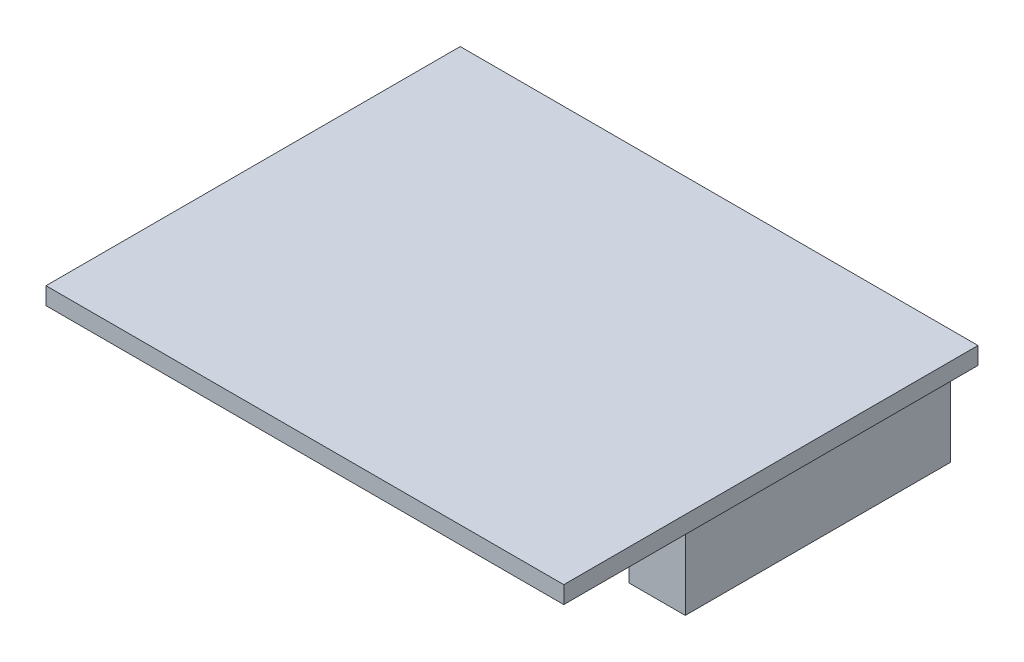
ISO-10303-21;
HEADER;
FILE_DESCRIPTION(('STEP AP214'),'2;1');
FILE_NAME('part.step','',(''),(''),'','','');
FILE_SCHEMA(('AUTOMOTIVE_DESIGN { 1 0 10303 214 1 1 1 1 }'));
ENDSEC;
DATA;
#1=APPLICATION_CONTEXT('core data for automotive mechanical design processes');
#2=APPLICATION_PROTOCOL_DEFINITION('international standard','automotive_design',2000,#1);
#3=PRODUCT_CONTEXT('',#1,'mechanical');
#4=PRODUCT('Part','Part','',(#3));
#5=PRODUCT_RELATED_PRODUCT_CATEGORY('part','',(#4));
#6=PRODUCT_DEFINITION_FORMATION('','',#4);
#7=PRODUCT_DEFINITION_CONTEXT('part definition',#1,'design');
#8=PRODUCT_DEFINITION('design','',#6,#7);
#9=PRODUCT_DEFINITION_SHAPE('','',#8);
#10=(LENGTH_UNIT() NAMED_UNIT(*) SI_UNIT(.MILLI.,.METRE.));
#11=(NAMED_UNIT(*) PLANE_ANGLE_UNIT() SI_UNIT($,.RADIAN.));
#12=(NAMED_UNIT(*) SI_UNIT($,.STERADIAN.) SOLID_ANGLE_UNIT());
#13=UNCERTAINTY_MEASURE_WITH_UNIT(LENGTH_MEASURE(1.E-05),#10,'distance_accuracy_value','');
#14=(GEOMETRIC_REPRESENTATION_CONTEXT(3) GLOBAL_UNCERTAINTY_ASSIGNED_CONTEXT((#13)) GLOBAL_UNIT_ASSIGNED_CONTEXT((#10,
#11,#12)) REPRESENTATION_CONTEXT('',''));
#15=CARTESIAN_POINT('',(0.,0.,0.));
#16=DIRECTION('',(0.,0.,1.));
#17=DIRECTION('',(1.,0.,0.));
#18=AXIS2_PLACEMENT_3D('',#15,#16,#17);
#19=CARTESIAN_POINT('',(0.,0.,0.));
#20=DIRECTION('',(0.,-1.,0.));
#21=DIRECTION('',(0.,0.,-1.));
#22=AXIS2_PLACEMENT_3D('',#19,#20,#21);
#23=PLANE('',#22);
#24=DIRECTION('',(0.,0.,-1.));
#25=VECTOR('',#24,1.);
#26=CARTESIAN_POINT('',(25.4,0.,20.32));
#27=LINE('',#26,#25);
#28=CARTESIAN_POINT('',(25.4,0.,20.32));
#29=VERTEX_POINT('',#28);
#30=CARTESIAN_POINT('',(25.4,0.,-20.32));
#31=VERTEX_POINT('',#30);
#32=EDGE_CURVE('E188',#29,#31,#27,.T.);
#33=ORIENTED_EDGE('',*,*,#32,.F.);
#34=DIRECTION('',(1.,0.,0.));
#35=VECTOR('',#34,1.);
#36=CARTESIAN_POINT('',(-25.4,0.,20.32));
#37=LINE('',#36,#35);
#38=CARTESIAN_POINT('',(-25.4,0.,20.32));
#39=VERTEX_POINT('',#38);
#40=EDGE_CURVE('E193',#39,#29,#37,.T.);
#41=ORIENTED_EDGE('',*,*,#40,.F.);
#42=DIRECTION('',(0.,0.,1.));
#43=VECTOR('',#42,1.);
#44=CARTESIAN_POINT('',(-25.4,0.,20.32));
#45=LINE('',#44,#43);
#46=CARTESIAN_POINT('',(-25.4,0.,-20.32));
#47=VERTEX_POINT('',#46);
#48=EDGE_CURVE('E204',#47,#39,#45,.T.);
#49=ORIENTED_EDGE('',*,*,#48,.F.);
#50=DIRECTION('',(-1.,0.,0.));
#51=VECTOR('',#50,1.);
#52=CARTESIAN_POINT('',(-25.4,0.,-20.32));
#53=LINE('',#52,#51);
#54=EDGE_CURVE('E202',#31,#47,#53,.T.);
#55=ORIENTED_EDGE('',*,*,#54,.F.);
#56=EDGE_LOOP('',(#33,#41,#49,#55));
#57=FACE_BOUND('',#56,.T.);
#58=DIRECTION('',(-1.,0.,0.));
#59=VECTOR('',#58,1.);
#60=CARTESIAN_POINT('',(-24.4,0.,6.68));
#61=LINE('',#60,#59);
#62=CARTESIAN_POINT('',(-19.4,0.,6.68));
#63=VERTEX_POINT('',#62);
#64=CARTESIAN_POINT('',(-24.4,0.,6.68));
#65=VERTEX_POINT('',#64);
#66=EDGE_CURVE('E174',#63,#65,#61,.T.);
#67=ORIENTED_EDGE('',*,*,#66,.F.);
#68=DIRECTION('',(0.,0.,1.));
#69=VECTOR('',#68,1.);
#70=CARTESIAN_POINT('',(-19.4,0.,-19.32));
#71=LINE('',#70,#69);
#72=CARTESIAN_POINT('',(-19.4,0.,-19.32));
#73=VERTEX_POINT('',#72);
#74=EDGE_CURVE('E171',#73,#63,#71,.T.);
#75=ORIENTED_EDGE('',*,*,#74,.F.);
#76=DIRECTION('',(1.,0.,0.));
#77=VECTOR('',#76,1.);
#78=CARTESIAN_POINT('',(-24.4,0.,-19.32));
#79=LINE('',#78,#77);
#80=CARTESIAN_POINT('',(-24.4,0.,-19.32));
#81=VERTEX_POINT('',#80);
#82=EDGE_CURVE('E164',#81,#73,#79,.T.);
#83=ORIENTED_EDGE('',*,*,#82,.F.);
#84=DIRECTION('',(0.,0.,-1.));
#85=VECTOR('',#84,1.);
#86=CARTESIAN_POINT('',(-24.4,0.,-19.32));
#87=LINE('',#86,#85);
#88=EDGE_CURVE('E177',#65,#81,#87,.T.);
#89=ORIENTED_EDGE('',*,*,#88,.F.);
#90=EDGE_LOOP('',(#67,#75,#83,#89));
#91=FACE_BOUND('',#90,.T.);
#92=DIRECTION('',(0.,0.,1.));
#93=VECTOR('',#92,1.);
#94=CARTESIAN_POINT('',(23.68,0.,-19.32));
#95=LINE('',#94,#93);
#96=CARTESIAN_POINT('',(23.68,0.,-19.32));
#97=VERTEX_POINT('',#96);
#98=CARTESIAN_POINT('',(23.68,0.,6.68));
#99=VERTEX_POINT('',#98);
#100=EDGE_CURVE('E141',#97,#99,#95,.T.);
#101=ORIENTED_EDGE('',*,*,#100,.F.);
#102=DIRECTION('',(1.,0.,0.));
#103=VECTOR('',#102,1.);
#104=CARTESIAN_POINT('',(18.18,0.,-19.32));
#105=LINE('',#104,#103);
#106=CARTESIAN_POINT('',(18.18,0.,-19.32));
#107=VERTEX_POINT('',#106);
#108=EDGE_CURVE('E50',#107,#97,#105,.T.);
#109=ORIENTED_EDGE('',*,*,#108,.F.);
#110=DIRECTION('',(0.,0.,-1.));
#111=VECTOR('',#110,1.);
#112=CARTESIAN_POINT('',(18.18,0.,-19.32));
#113=LINE('',#112,#111);
#114=CARTESIAN_POINT('',(18.18,0.,6.68));
#115=VERTEX_POINT('',#114);
#116=EDGE_CURVE('E147',#115,#107,#113,.T.);
#117=ORIENTED_EDGE('',*,*,#116,.F.);
#118=DIRECTION('',(-1.,0.,0.));
#119=VECTOR('',#118,1.);
#120=CARTESIAN_POINT('',(18.18,0.,6.68));
#121=LINE('',#120,#119);
#122=EDGE_CURVE('E132',#99,#115,#121,.T.);
#123=ORIENTED_EDGE('',*,*,#122,.F.);
#124=EDGE_LOOP('',(#101,#109,#117,#123));
#125=FACE_BOUND('',#124,.T.);
#126=ADVANCED_FACE('F35',(#57,#91,#125),#23,.T.);
#127=CARTESIAN_POINT('',(25.4,1.7,20.32));
#128=DIRECTION('',(-1.,0.,0.));
#129=DIRECTION('',(0.,0.,1.));
#130=AXIS2_PLACEMENT_3D('',#127,#128,#129);
#131=PLANE('',#130);
#132=ORIENTED_EDGE('',*,*,#32,.T.);
#133=DIRECTION('',(0.,-1.,0.));
#134=VECTOR('',#133,1.);
#135=CARTESIAN_POINT('',(25.4,1.7,-20.32));
#136=LINE('',#135,#134);
#137=CARTESIAN_POINT('',(25.4,1.7,-20.32));
#138=VERTEX_POINT('',#137);
#139=EDGE_CURVE('E11',#138,#31,#136,.T.);
#140=ORIENTED_EDGE('',*,*,#139,.F.);
#141=DIRECTION('',(0.,0.,-1.));
#142=VECTOR('',#141,1.);
#143=CARTESIAN_POINT('',(25.4,1.7,20.32));
#144=LINE('',#143,#142);
#145=CARTESIAN_POINT('',(25.4,1.7,20.32));
#146=VERTEX_POINT('',#145);
#147=EDGE_CURVE('E189',#146,#138,#144,.T.);
#148=ORIENTED_EDGE('',*,*,#147,.F.);
#149=DIRECTION('',(0.,-1.,0.));
#150=VECTOR('',#149,1.);
#151=CARTESIAN_POINT('',(25.4,1.7,20.32));
#152=LINE('',#151,#150);
#153=EDGE_CURVE('E199',#146,#29,#152,.T.);
#154=ORIENTED_EDGE('',*,*,#153,.T.);
#155=EDGE_LOOP('',(#132,#140,#148,#154));
#156=FACE_BOUND('',#155,.T.);
#157=ADVANCED_FACE('F37',(#156),#131,.F.);
#158=CARTESIAN_POINT('',(-25.4,1.7,-20.32));
#159=DIRECTION('',(0.,0.,1.));
#160=DIRECTION('',(1.,0.,0.));
#161=AXIS2_PLACEMENT_3D('',#158,#159,#160);
#162=PLANE('',#161);
#163=ORIENTED_EDGE('',*,*,#54,.T.);
#164=DIRECTION('',(0.,-1.,0.));
#165=VECTOR('',#164,1.);
#166=CARTESIAN_POINT('',(-25.4,1.7,-20.32));
#167=LINE('',#166,#165);
#168=CARTESIAN_POINT('',(-25.4,1.7,-20.32));
#169=VERTEX_POINT('',#168);
#170=EDGE_CURVE('E43',#169,#47,#167,.T.);
#171=ORIENTED_EDGE('',*,*,#170,.F.);
#172=DIRECTION('',(-1.,0.,0.));
#173=VECTOR('',#172,1.);
#174=CARTESIAN_POINT('',(-25.4,1.7,-20.32));
#175=LINE('',#174,#173);
#176=EDGE_CURVE('E192',#138,#169,#175,.T.);
#177=ORIENTED_EDGE('',*,*,#176,.F.);
#178=ORIENTED_EDGE('',*,*,#139,.T.);
#179=EDGE_LOOP('',(#163,#171,#177,#178));
#180=FACE_BOUND('',#179,.T.);
#181=ADVANCED_FACE('F232',(#180),#162,.F.);
#182=CARTESIAN_POINT('',(-25.4,1.7,20.32));
#183=DIRECTION('',(1.,0.,0.));
#184=DIRECTION('',(0.,0.,-1.));
#185=AXIS2_PLACEMENT_3D('',#182,#183,#184);
#186=PLANE('',#185);
#187=ORIENTED_EDGE('',*,*,#48,.T.);
#188=DIRECTION('',(0.,-1.,0.));
#189=VECTOR('',#188,1.);
#190=CARTESIAN_POINT('',(-25.4,1.7,20.32));
#191=LINE('',#190,#189);
#192=CARTESIAN_POINT('',(-25.4,1.7,20.32));
#193=VERTEX_POINT('',#192);
#194=EDGE_CURVE('E209',#193,#39,#191,.T.);
#195=ORIENTED_EDGE('',*,*,#194,.F.);
#196=DIRECTION('',(0.,0.,1.));
#197=VECTOR('',#196,1.);
#198=CARTESIAN_POINT('',(-25.4,1.7,20.32));
#199=LINE('',#198,#197);
#200=EDGE_CURVE('E195',#169,#193,#199,.T.);
#201=ORIENTED_EDGE('',*,*,#200,.F.);
#202=ORIENTED_EDGE('',*,*,#170,.T.);
#203=EDGE_LOOP('',(#187,#195,#201,#202));
#204=FACE_BOUND('',#203,.T.);
#205=ADVANCED_FACE('F216',(#204),#186,.F.);
#206=CARTESIAN_POINT('',(-25.4,1.7,20.32));
#207=DIRECTION('',(0.,0.,-1.));
#208=DIRECTION('',(-1.,0.,0.));
#209=AXIS2_PLACEMENT_3D('',#206,#207,#208);
#210=PLANE('',#209);
#211=ORIENTED_EDGE('',*,*,#40,.T.);
#212=ORIENTED_EDGE('',*,*,#153,.F.);
#213=DIRECTION('',(1.,0.,0.));
#214=VECTOR('',#213,1.);
#215=CARTESIAN_POINT('',(-25.4,1.7,20.32));
#216=LINE('',#215,#214);
#217=EDGE_CURVE('E197',#193,#146,#216,.T.);
#218=ORIENTED_EDGE('',*,*,#217,.F.);
#219=ORIENTED_EDGE('',*,*,#194,.T.);
#220=EDGE_LOOP('',(#211,#212,#218,#219));
#221=FACE_BOUND('',#220,.T.);
#222=ADVANCED_FACE('F225',(#221),#210,.F.);
#223=CARTESIAN_POINT('',(0.,1.7,0.));
#224=DIRECTION('',(0.,-1.,0.));
#225=DIRECTION('',(0.,0.,-1.));
#226=AXIS2_PLACEMENT_3D('',#223,#224,#225);
#227=PLANE('',#226);
#228=ORIENTED_EDGE('',*,*,#147,.T.);
#229=ORIENTED_EDGE('',*,*,#176,.T.);
#230=ORIENTED_EDGE('',*,*,#200,.T.);
#231=ORIENTED_EDGE('',*,*,#217,.T.);
#232=EDGE_LOOP('',(#228,#229,#230,#231));
#233=FACE_BOUND('',#232,.T.);
#234=ADVANCED_FACE('F231',(#233),#227,.F.);
#235=CARTESIAN_POINT('',(-19.4,-8.6,-19.32));
#236=DIRECTION('',(-1.,0.,0.));
#237=DIRECTION('',(0.,0.,1.));
#238=AXIS2_PLACEMENT_3D('',#235,#236,#237);
#239=PLANE('',#238);
#240=ORIENTED_EDGE('',*,*,#74,.T.);
#241=DIRECTION('',(0.,1.,0.));
#242=VECTOR('',#241,1.);
#243=CARTESIAN_POINT('',(-19.4,-8.6,6.68));
#244=LINE('',#243,#242);
#245=CARTESIAN_POINT('',(-19.4,-8.6,6.68));
#246=VERTEX_POINT('',#245);
#247=EDGE_CURVE('E186',#246,#63,#244,.T.);
#248=ORIENTED_EDGE('',*,*,#247,.F.);
#249=DIRECTION('',(0.,0.,1.));
#250=VECTOR('',#249,1.);
#251=CARTESIAN_POINT('',(-19.4,-8.6,-19.32));
#252=LINE('',#251,#250);
#253=CARTESIAN_POINT('',(-19.4,-8.6,-19.32));
#254=VERTEX_POINT('',#253);
#255=EDGE_CURVE('E160',#254,#246,#252,.T.);
#256=ORIENTED_EDGE('',*,*,#255,.F.);
#257=DIRECTION('',(0.,1.,0.));
#258=VECTOR('',#257,1.);
#259=CARTESIAN_POINT('',(-19.4,-8.6,-19.32));
#260=LINE('',#259,#258);
#261=EDGE_CURVE('E170',#254,#73,#260,.T.);
#262=ORIENTED_EDGE('',*,*,#261,.T.);
#263=EDGE_LOOP('',(#240,#248,#256,#262));
#264=FACE_BOUND('',#263,.T.);
#265=ADVANCED_FACE('F250',(#264),#239,.F.);
#266=CARTESIAN_POINT('',(-24.4,-8.6,6.68));
#267=DIRECTION('',(0.,0.,-1.));
#268=DIRECTION('',(-1.,0.,0.));
#269=AXIS2_PLACEMENT_3D('',#266,#267,#268);
#270=PLANE('',#269);
#271=ORIENTED_EDGE('',*,*,#66,.T.);
#272=DIRECTION('',(0.,1.,0.));
#273=VECTOR('',#272,1.);
#274=CARTESIAN_POINT('',(-24.4,-8.6,6.68));
#275=LINE('',#274,#273);
#276=CARTESIAN_POINT('',(-24.4,-8.6,6.68));
#277=VERTEX_POINT('',#276);
#278=EDGE_CURVE('E183',#277,#65,#275,.T.);
#279=ORIENTED_EDGE('',*,*,#278,.F.);
#280=DIRECTION('',(-1.,0.,0.));
#281=VECTOR('',#280,1.);
#282=CARTESIAN_POINT('',(-24.4,-8.6,6.68));
#283=LINE('',#282,#281);
#284=EDGE_CURVE('E163',#246,#277,#283,.T.);
#285=ORIENTED_EDGE('',*,*,#284,.F.);
#286=ORIENTED_EDGE('',*,*,#247,.T.);
#287=EDGE_LOOP('',(#271,#279,#285,#286));
#288=FACE_BOUND('',#287,.T.);
#289=ADVANCED_FACE('F254',(#288),#270,.F.);
#290=CARTESIAN_POINT('',(-24.4,-8.6,-19.32));
#291=DIRECTION('',(1.,0.,0.));
#292=DIRECTION('',(0.,0.,-1.));
#293=AXIS2_PLACEMENT_3D('',#290,#291,#292);
#294=PLANE('',#293);
#295=ORIENTED_EDGE('',*,*,#88,.T.);
#296=DIRECTION('',(0.,1.,0.));
#297=VECTOR('',#296,1.);
#298=CARTESIAN_POINT('',(-24.4,-8.6,-19.32));
#299=LINE('',#298,#297);
#300=CARTESIAN_POINT('',(-24.4,-8.6,-19.32));
#301=VERTEX_POINT('',#300);
#302=EDGE_CURVE('E58',#301,#81,#299,.T.);
#303=ORIENTED_EDGE('',*,*,#302,.F.);
#304=DIRECTION('',(0.,0.,-1.));
#305=VECTOR('',#304,1.);
#306=CARTESIAN_POINT('',(-24.4,-8.6,-19.32));
#307=LINE('',#306,#305);
#308=EDGE_CURVE('E166',#277,#301,#307,.T.);
#309=ORIENTED_EDGE('',*,*,#308,.F.);
#310=ORIENTED_EDGE('',*,*,#278,.T.);
#311=EDGE_LOOP('',(#295,#303,#309,#310));
#312=FACE_BOUND('',#311,.T.);
#313=ADVANCED_FACE('F259',(#312),#294,.F.);
#314=CARTESIAN_POINT('',(-24.4,-8.6,-19.32));
#315=DIRECTION('',(0.,0.,1.));
#316=DIRECTION('',(1.,0.,0.));
#317=AXIS2_PLACEMENT_3D('',#314,#315,#316);
#318=PLANE('',#317);
#319=ORIENTED_EDGE('',*,*,#82,.T.);
#320=ORIENTED_EDGE('',*,*,#261,.F.);
#321=DIRECTION('',(1.,0.,0.));
#322=VECTOR('',#321,1.);
#323=CARTESIAN_POINT('',(-24.4,-8.6,-19.32));
#324=LINE('',#323,#322);
#325=EDGE_CURVE('E168',#301,#254,#324,.T.);
#326=ORIENTED_EDGE('',*,*,#325,.F.);
#327=ORIENTED_EDGE('',*,*,#302,.T.);
#328=EDGE_LOOP('',(#319,#320,#326,#327));
#329=FACE_BOUND('',#328,.T.);
#330=ADVANCED_FACE('F265',(#329),#318,.F.);
#331=CARTESIAN_POINT('',(0.,-8.6,0.));
#332=DIRECTION('',(0.,1.,0.));
#333=DIRECTION('',(0.,0.,1.));
#334=AXIS2_PLACEMENT_3D('',#331,#332,#333);
#335=PLANE('',#334);
#336=ORIENTED_EDGE('',*,*,#255,.T.);
#337=ORIENTED_EDGE('',*,*,#284,.T.);
#338=ORIENTED_EDGE('',*,*,#308,.T.);
#339=ORIENTED_EDGE('',*,*,#325,.T.);
#340=EDGE_LOOP('',(#336,#337,#338,#339));
#341=FACE_BOUND('',#340,.T.);
#342=ADVANCED_FACE('F269',(#341),#335,.F.);
#343=CARTESIAN_POINT('',(18.18,-35.1753645318366,-19.32));
#344=DIRECTION('',(0.,0.,1.));
#345=DIRECTION('',(1.,0.,0.));
#346=AXIS2_PLACEMENT_3D('',#343,#344,#345);
#347=PLANE('',#346);
#348=DIRECTION('',(0.,1.,0.));
#349=VECTOR('',#348,1.);
#350=CARTESIAN_POINT('',(23.68,-35.1753645318366,-19.32));
#351=LINE('',#350,#349);
#352=CARTESIAN_POINT('',(23.68,-8.6,-19.32));
#353=VERTEX_POINT('',#352);
#354=EDGE_CURVE('E143',#353,#97,#351,.T.);
#355=ORIENTED_EDGE('',*,*,#354,.F.);
#356=DIRECTION('',(-1.,0.,0.));
#357=VECTOR('',#356,1.);
#358=CARTESIAN_POINT('',(18.18,-8.6,-19.32));
#359=LINE('',#358,#357);
#360=CARTESIAN_POINT('',(18.18,-8.60000000000001,-19.32));
#361=VERTEX_POINT('',#360);
#362=EDGE_CURVE('E137',#353,#361,#359,.T.);
#363=ORIENTED_EDGE('',*,*,#362,.T.);
#364=DIRECTION('',(0.,1.,0.));
#365=VECTOR('',#364,1.);
#366=CARTESIAN_POINT('',(18.18,-35.1753645318366,-19.32));
#367=LINE('',#366,#365);
#368=EDGE_CURVE('E154',#361,#107,#367,.T.);
#369=ORIENTED_EDGE('',*,*,#368,.T.);
#370=ORIENTED_EDGE('',*,*,#108,.T.);
#371=EDGE_LOOP('',(#355,#363,#369,#370));
#372=FACE_BOUND('',#371,.T.);
#373=ADVANCED_FACE('F272',(#372),#347,.F.);
#374=CARTESIAN_POINT('',(18.18,-35.1753645318366,-19.32));
#375=DIRECTION('',(1.,0.,0.));
#376=DIRECTION('',(0.,0.,-1.));
#377=AXIS2_PLACEMENT_3D('',#374,#375,#376);
#378=PLANE('',#377);
#379=ORIENTED_EDGE('',*,*,#368,.F.);
#380=DIRECTION('',(0.,0.,1.));
#381=VECTOR('',#380,1.);
#382=CARTESIAN_POINT('',(18.18,-8.6,-19.32));
#383=LINE('',#382,#381);
#384=CARTESIAN_POINT('',(18.18,-8.6,6.68));
#385=VERTEX_POINT('',#384);
#386=EDGE_CURVE('E159',#361,#385,#383,.T.);
#387=ORIENTED_EDGE('',*,*,#386,.T.);
#388=DIRECTION('',(0.,1.,0.));
#389=VECTOR('',#388,1.);
#390=CARTESIAN_POINT('',(18.18,-35.1753645318366,6.68));
#391=LINE('',#390,#389);
#392=EDGE_CURVE('E138',#385,#115,#391,.T.);
#393=ORIENTED_EDGE('',*,*,#392,.T.);
#394=ORIENTED_EDGE('',*,*,#116,.T.);
#395=EDGE_LOOP('',(#379,#387,#393,#394));
#396=FACE_BOUND('',#395,.T.);
#397=ADVANCED_FACE('F279',(#396),#378,.F.);
#398=CARTESIAN_POINT('',(18.18,-35.1753645318366,6.68));
#399=DIRECTION('',(0.,0.,-1.));
#400=DIRECTION('',(-1.,0.,0.));
#401=AXIS2_PLACEMENT_3D('',#398,#399,#400);
#402=PLANE('',#401);
#403=ORIENTED_EDGE('',*,*,#392,.F.);
#404=DIRECTION('',(1.,0.,0.));
#405=VECTOR('',#404,1.);
#406=CARTESIAN_POINT('',(18.18,-8.6,6.68));
#407=LINE('',#406,#405);
#408=CARTESIAN_POINT('',(23.68,-8.6,6.68));
#409=VERTEX_POINT('',#408);
#410=EDGE_CURVE('E134',#385,#409,#407,.T.);
#411=ORIENTED_EDGE('',*,*,#410,.T.);
#412=DIRECTION('',(0.,1.,0.));
#413=VECTOR('',#412,1.);
#414=CARTESIAN_POINT('',(23.68,-35.1753645318366,6.68));
#415=LINE('',#414,#413);
#416=EDGE_CURVE('E127',#409,#99,#415,.T.);
#417=ORIENTED_EDGE('',*,*,#416,.T.);
#418=ORIENTED_EDGE('',*,*,#122,.T.);
#419=EDGE_LOOP('',(#403,#411,#417,#418));
#420=FACE_BOUND('',#419,.T.);
#421=ADVANCED_FACE('F130',(#420),#402,.F.);
#422=CARTESIAN_POINT('',(23.68,-35.1753645318366,-19.32));
#423=DIRECTION('',(-1.,0.,0.));
#424=DIRECTION('',(0.,0.,1.));
#425=AXIS2_PLACEMENT_3D('',#422,#423,#424);
#426=PLANE('',#425);
#427=ORIENTED_EDGE('',*,*,#416,.F.);
#428=DIRECTION('',(0.,0.,-1.));
#429=VECTOR('',#428,1.);
#430=CARTESIAN_POINT('',(23.68,-8.6,-19.32));
#431=LINE('',#430,#429);
#432=EDGE_CURVE('E175',#409,#353,#431,.T.);
#433=ORIENTED_EDGE('',*,*,#432,.T.);
#434=ORIENTED_EDGE('',*,*,#354,.T.);
#435=ORIENTED_EDGE('',*,*,#100,.T.);
#436=EDGE_LOOP('',(#427,#433,#434,#435));
#437=FACE_BOUND('',#436,.T.);
#438=ADVANCED_FACE('F142',(#437),#426,.F.);
#439=CARTESIAN_POINT('',(0.,-8.6,0.));
#440=DIRECTION('',(0.,1.,0.));
#441=DIRECTION('',(0.,0.,1.));
#442=AXIS2_PLACEMENT_3D('',#439,#440,#441);
#443=PLANE('',#442);
#444=ORIENTED_EDGE('',*,*,#410,.F.);
#445=ORIENTED_EDGE('',*,*,#386,.F.);
#446=ORIENTED_EDGE('',*,*,#362,.F.);
#447=ORIENTED_EDGE('',*,*,#432,.F.);
#448=EDGE_LOOP('',(#444,#445,#446,#447));
#449=FACE_BOUND('',#448,.T.);
#450=ADVANCED_FACE('F276',(#449),#443,.F.);
#451=CLOSED_SHELL('',(#126,#157,#181,#205,#222,#234,#265,#289,#313,#330,#342,#373,#397,#421,
#438,#450));
#452=MANIFOLD_SOLID_BREP('B2',#451);
#453=ADVANCED_BREP_SHAPE_REPRESENTATION('',(#18,#452),#14);
#454=SHAPE_DEFINITION_REPRESENTATION(#9,#453);
ENDSEC;
END-ISO-10303-21;
